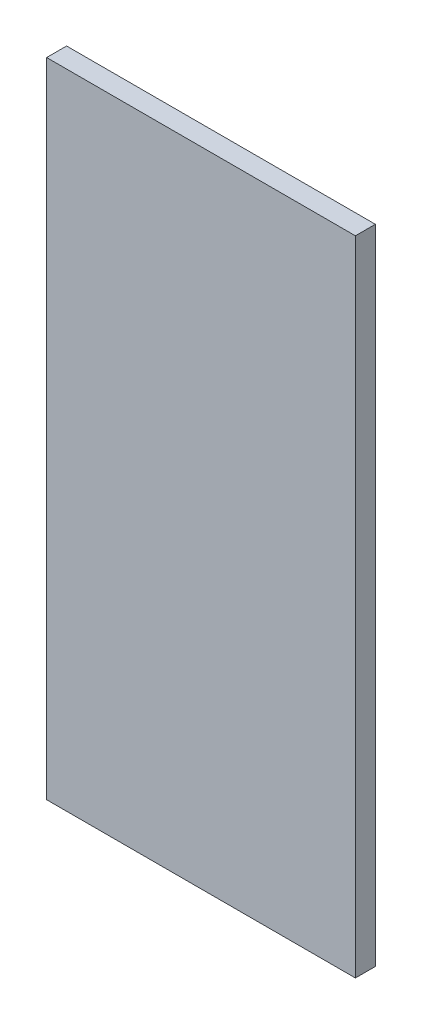
ISO-10303-21;
HEADER;
FILE_DESCRIPTION(('STEP AP214'),'2;1');
FILE_NAME('part.step','',(''),(''),'','','');
FILE_SCHEMA(('AUTOMOTIVE_DESIGN { 1 0 10303 214 1 1 1 1 }'));
ENDSEC;
DATA;
#1=APPLICATION_CONTEXT('core data for automotive mechanical design processes');
#2=APPLICATION_PROTOCOL_DEFINITION('international standard','automotive_design',2000,#1);
#3=PRODUCT_CONTEXT('',#1,'mechanical');
#4=PRODUCT('Part','Part','',(#3));
#5=PRODUCT_RELATED_PRODUCT_CATEGORY('part','',(#4));
#6=PRODUCT_DEFINITION_FORMATION('','',#4);
#7=PRODUCT_DEFINITION_CONTEXT('part definition',#1,'design');
#8=PRODUCT_DEFINITION('design','',#6,#7);
#9=PRODUCT_DEFINITION_SHAPE('','',#8);
#10=(LENGTH_UNIT() NAMED_UNIT(*) SI_UNIT(.MILLI.,.METRE.));
#11=(NAMED_UNIT(*) PLANE_ANGLE_UNIT() SI_UNIT($,.RADIAN.));
#12=(NAMED_UNIT(*) SI_UNIT($,.STERADIAN.) SOLID_ANGLE_UNIT());
#13=UNCERTAINTY_MEASURE_WITH_UNIT(LENGTH_MEASURE(1.E-05),#10,'distance_accuracy_value','');
#14=(GEOMETRIC_REPRESENTATION_CONTEXT(3) GLOBAL_UNCERTAINTY_ASSIGNED_CONTEXT((#13)) GLOBAL_UNIT_ASSIGNED_CONTEXT((#10,
#11,#12)) REPRESENTATION_CONTEXT('',''));
#15=CARTESIAN_POINT('',(0.,0.,0.));
#16=DIRECTION('',(0.,0.,1.));
#17=DIRECTION('',(1.,0.,0.));
#18=AXIS2_PLACEMENT_3D('',#15,#16,#17);
#19=CARTESIAN_POINT('',(88.6419982910156,100.66300201416,0.));
#20=DIRECTION('',(1.,0.,0.));
#21=DIRECTION('',(0.,-1.,0.));
#22=AXIS2_PLACEMENT_3D('',#19,#20,#21);
#23=PLANE('',#22);
#24=DIRECTION('',(0.,-1.,0.));
#25=VECTOR('',#24,1.);
#26=CARTESIAN_POINT('',(88.6419982910156,100.66300201416,0.03556));
#27=LINE('',#26,#25);
#28=CARTESIAN_POINT('',(88.6419982910156,100.66300201416,0.03556));
#29=VERTEX_POINT('',#28);
#30=CARTESIAN_POINT('',(88.6419982910156,99.5179977416992,0.03556));
#31=VERTEX_POINT('',#30);
#32=EDGE_CURVE('E11',#29,#31,#27,.T.);
#33=ORIENTED_EDGE('',*,*,#32,.F.);
#34=DIRECTION('',(0.,0.,1.));
#35=VECTOR('',#34,1.);
#36=CARTESIAN_POINT('',(88.6419982910156,100.66300201416,0.));
#37=LINE('',#36,#35);
#38=CARTESIAN_POINT('',(88.6419982910156,100.66300201416,0.));
#39=VERTEX_POINT('',#38);
#40=EDGE_CURVE('E24',#39,#29,#37,.T.);
#41=ORIENTED_EDGE('',*,*,#40,.F.);
#42=DIRECTION('',(0.,-1.,0.));
#43=VECTOR('',#42,1.);
#44=CARTESIAN_POINT('',(88.6419982910156,100.66300201416,0.));
#45=LINE('',#44,#43);
#46=CARTESIAN_POINT('',(88.6419982910156,99.5179977416992,0.));
#47=VERTEX_POINT('',#46);
#48=EDGE_CURVE('E75',#39,#47,#45,.T.);
#49=ORIENTED_EDGE('',*,*,#48,.T.);
#50=DIRECTION('',(0.,0.,1.));
#51=VECTOR('',#50,1.);
#52=CARTESIAN_POINT('',(88.6419982910156,99.5179977416992,0.));
#53=LINE('',#52,#51);
#54=EDGE_CURVE('E37',#47,#31,#53,.T.);
#55=ORIENTED_EDGE('',*,*,#54,.T.);
#56=EDGE_LOOP('',(#33,#41,#49,#55));
#57=FACE_BOUND('',#56,.T.);
#58=ADVANCED_FACE('F17',(#57),#23,.F.);
#59=CARTESIAN_POINT('',(88.6419982910156,99.5179977416992,0.));
#60=DIRECTION('',(0.,1.,0.));
#61=DIRECTION('',(1.,0.,0.));
#62=AXIS2_PLACEMENT_3D('',#59,#60,#61);
#63=PLANE('',#62);
#64=DIRECTION('',(1.,0.,0.));
#65=VECTOR('',#64,1.);
#66=CARTESIAN_POINT('',(88.6419982910156,99.5179977416992,0.03556));
#67=LINE('',#66,#65);
#68=CARTESIAN_POINT('',(89.1920013427734,99.5179977416992,0.03556));
#69=VERTEX_POINT('',#68);
#70=EDGE_CURVE('E83',#31,#69,#67,.T.);
#71=ORIENTED_EDGE('',*,*,#70,.F.);
#72=ORIENTED_EDGE('',*,*,#54,.F.);
#73=DIRECTION('',(1.,0.,0.));
#74=VECTOR('',#73,1.);
#75=CARTESIAN_POINT('',(88.6419982910156,99.5179977416992,0.));
#76=LINE('',#75,#74);
#77=CARTESIAN_POINT('',(89.1920013427734,99.5179977416992,0.));
#78=VERTEX_POINT('',#77);
#79=EDGE_CURVE('E81',#47,#78,#76,.T.);
#80=ORIENTED_EDGE('',*,*,#79,.T.);
#81=DIRECTION('',(0.,0.,1.));
#82=VECTOR('',#81,1.);
#83=CARTESIAN_POINT('',(89.1920013427734,99.5179977416992,0.));
#84=LINE('',#83,#82);
#85=EDGE_CURVE('E67',#78,#69,#84,.T.);
#86=ORIENTED_EDGE('',*,*,#85,.T.);
#87=EDGE_LOOP('',(#71,#72,#80,#86));
#88=FACE_BOUND('',#87,.T.);
#89=ADVANCED_FACE('F89',(#88),#63,.F.);
#90=CARTESIAN_POINT('',(89.1920013427734,99.5179977416992,0.));
#91=DIRECTION('',(-1.,0.,0.));
#92=DIRECTION('',(0.,1.,0.));
#93=AXIS2_PLACEMENT_3D('',#90,#91,#92);
#94=PLANE('',#93);
#95=DIRECTION('',(0.,1.,0.));
#96=VECTOR('',#95,1.);
#97=CARTESIAN_POINT('',(89.1920013427734,99.5179977416992,0.03556));
#98=LINE('',#97,#96);
#99=CARTESIAN_POINT('',(89.1920013427734,100.66300201416,0.03556));
#100=VERTEX_POINT('',#99);
#101=EDGE_CURVE('E71',#69,#100,#98,.T.);
#102=ORIENTED_EDGE('',*,*,#101,.F.);
#103=ORIENTED_EDGE('',*,*,#85,.F.);
#104=DIRECTION('',(0.,1.,0.));
#105=VECTOR('',#104,1.);
#106=CARTESIAN_POINT('',(89.1920013427734,99.5179977416992,0.));
#107=LINE('',#106,#105);
#108=CARTESIAN_POINT('',(89.1920013427734,100.66300201416,0.));
#109=VERTEX_POINT('',#108);
#110=EDGE_CURVE('E63',#78,#109,#107,.T.);
#111=ORIENTED_EDGE('',*,*,#110,.T.);
#112=DIRECTION('',(0.,0.,1.));
#113=VECTOR('',#112,1.);
#114=CARTESIAN_POINT('',(89.1920013427734,100.66300201416,0.));
#115=LINE('',#114,#113);
#116=EDGE_CURVE('E53',#109,#100,#115,.T.);
#117=ORIENTED_EDGE('',*,*,#116,.T.);
#118=EDGE_LOOP('',(#102,#103,#111,#117));
#119=FACE_BOUND('',#118,.T.);
#120=ADVANCED_FACE('F66',(#119),#94,.F.);
#121=CARTESIAN_POINT('',(89.1920013427734,100.66300201416,0.));
#122=DIRECTION('',(0.,-1.,0.));
#123=DIRECTION('',(-1.,0.,0.));
#124=AXIS2_PLACEMENT_3D('',#121,#122,#123);
#125=PLANE('',#124);
#126=DIRECTION('',(-1.,0.,0.));
#127=VECTOR('',#126,1.);
#128=CARTESIAN_POINT('',(89.1920013427734,100.66300201416,0.03556));
#129=LINE('',#128,#127);
#130=EDGE_CURVE('E59',#100,#29,#129,.T.);
#131=ORIENTED_EDGE('',*,*,#130,.F.);
#132=ORIENTED_EDGE('',*,*,#116,.F.);
#133=DIRECTION('',(-1.,0.,0.));
#134=VECTOR('',#133,1.);
#135=CARTESIAN_POINT('',(89.1920013427734,100.66300201416,0.));
#136=LINE('',#135,#134);
#137=EDGE_CURVE('E57',#109,#39,#136,.T.);
#138=ORIENTED_EDGE('',*,*,#137,.T.);
#139=ORIENTED_EDGE('',*,*,#40,.T.);
#140=EDGE_LOOP('',(#131,#132,#138,#139));
#141=FACE_BOUND('',#140,.T.);
#142=ADVANCED_FACE('F55',(#141),#125,.F.);
#143=CARTESIAN_POINT('',(88.6419982910156,100.66300201416,0.));
#144=DIRECTION('',(0.,0.,-1.));
#145=DIRECTION('',(-1.,0.,0.));
#146=AXIS2_PLACEMENT_3D('',#143,#144,#145);
#147=PLANE('',#146);
#148=ORIENTED_EDGE('',*,*,#137,.F.);
#149=ORIENTED_EDGE('',*,*,#110,.F.);
#150=ORIENTED_EDGE('',*,*,#79,.F.);
#151=ORIENTED_EDGE('',*,*,#48,.F.);
#152=EDGE_LOOP('',(#148,#149,#150,#151));
#153=FACE_BOUND('',#152,.T.);
#154=ADVANCED_FACE('F74',(#153),#147,.T.);
#155=CARTESIAN_POINT('',(88.6419982910156,100.66300201416,0.03556));
#156=DIRECTION('',(0.,0.,-1.));
#157=DIRECTION('',(-1.,0.,0.));
#158=AXIS2_PLACEMENT_3D('',#155,#156,#157);
#159=PLANE('',#158);
#160=ORIENTED_EDGE('',*,*,#32,.T.);
#161=ORIENTED_EDGE('',*,*,#70,.T.);
#162=ORIENTED_EDGE('',*,*,#101,.T.);
#163=ORIENTED_EDGE('',*,*,#130,.T.);
#164=EDGE_LOOP('',(#160,#161,#162,#163));
#165=FACE_BOUND('',#164,.T.);
#166=ADVANCED_FACE('F91',(#165),#159,.F.);
#167=CLOSED_SHELL('',(#58,#89,#120,#142,#154,#166));
#168=MANIFOLD_SOLID_BREP('B1',#167);
#169=ADVANCED_BREP_SHAPE_REPRESENTATION('',(#18,#168),#14);
#170=SHAPE_DEFINITION_REPRESENTATION(#9,#169);
ENDSEC;
END-ISO-10303-21;
